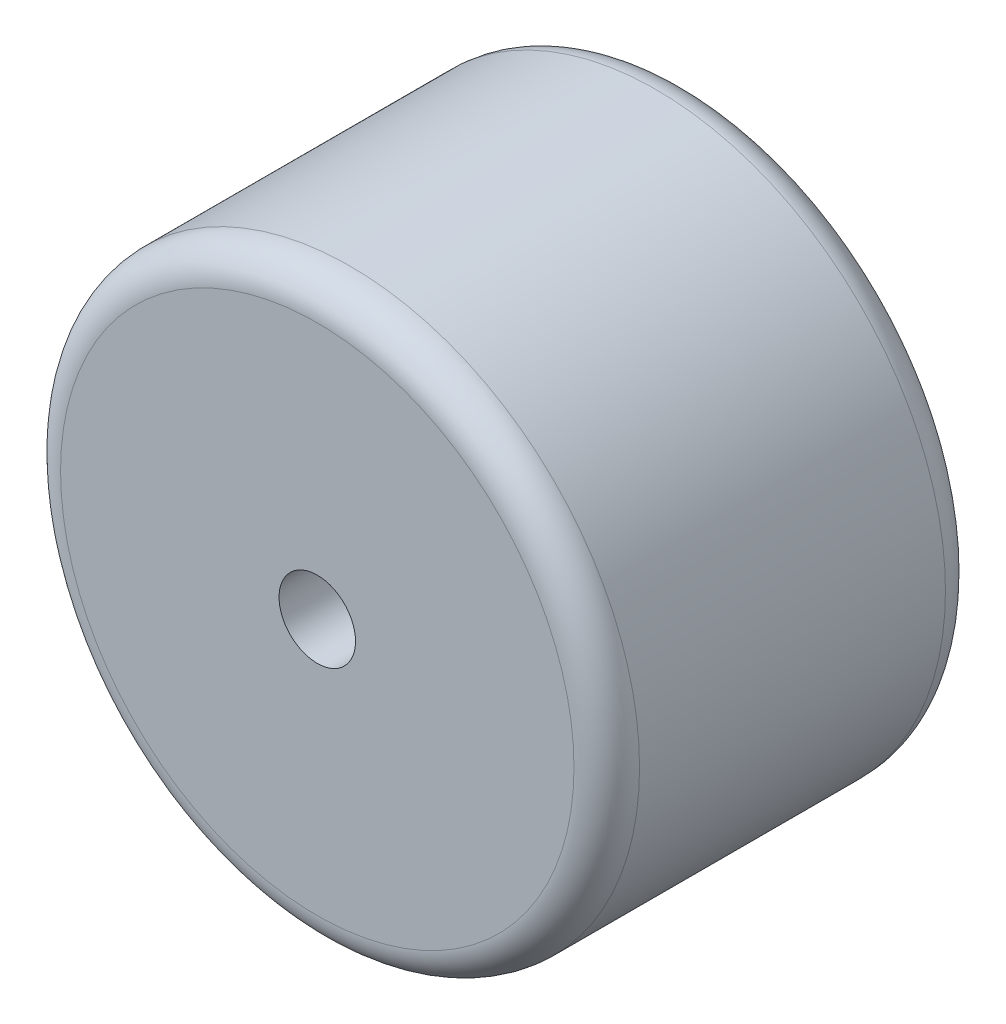
ISO-10303-21;
HEADER;
FILE_DESCRIPTION(('STEP AP214'),'2;1');
FILE_NAME('part.step','',(''),(''),'','','');
FILE_SCHEMA(('AUTOMOTIVE_DESIGN { 1 0 10303 214 1 1 1 1 }'));
ENDSEC;
DATA;
#1=APPLICATION_CONTEXT('core data for automotive mechanical design processes');
#2=APPLICATION_PROTOCOL_DEFINITION('international standard','automotive_design',2000,#1);
#3=PRODUCT_CONTEXT('',#1,'mechanical');
#4=PRODUCT('Part','Part','',(#3));
#5=PRODUCT_RELATED_PRODUCT_CATEGORY('part','',(#4));
#6=PRODUCT_DEFINITION_FORMATION('','',#4);
#7=PRODUCT_DEFINITION_CONTEXT('part definition',#1,'design');
#8=PRODUCT_DEFINITION('design','',#6,#7);
#9=PRODUCT_DEFINITION_SHAPE('','',#8);
#10=(LENGTH_UNIT() NAMED_UNIT(*) SI_UNIT(.MILLI.,.METRE.));
#11=(NAMED_UNIT(*) PLANE_ANGLE_UNIT() SI_UNIT($,.RADIAN.));
#12=(NAMED_UNIT(*) SI_UNIT($,.STERADIAN.) SOLID_ANGLE_UNIT());
#13=UNCERTAINTY_MEASURE_WITH_UNIT(LENGTH_MEASURE(1.E-05),#10,'distance_accuracy_value','');
#14=(GEOMETRIC_REPRESENTATION_CONTEXT(3) GLOBAL_UNCERTAINTY_ASSIGNED_CONTEXT((#13)) GLOBAL_UNIT_ASSIGNED_CONTEXT((#10,
#11,#12)) REPRESENTATION_CONTEXT('',''));
#15=CARTESIAN_POINT('',(0.,0.,0.));
#16=DIRECTION('',(0.,0.,1.));
#17=DIRECTION('',(1.,0.,0.));
#18=AXIS2_PLACEMENT_3D('',#15,#16,#17);
#19=CARTESIAN_POINT('',(0.,0.,34.));
#20=DIRECTION('',(0.,0.,-1.));
#21=DIRECTION('',(-1.,0.,0.));
#22=AXIS2_PLACEMENT_3D('',#19,#20,#21);
#23=CYLINDRICAL_SURFACE('',#22,26.5);
#24=CARTESIAN_POINT('',(0.,0.,3.));
#25=DIRECTION('',(0.,0.,1.));
#26=DIRECTION('',(1.,0.,0.));
#27=AXIS2_PLACEMENT_3D('',#24,#25,#26);
#28=CIRCLE('',#27,26.5);
#29=CARTESIAN_POINT('',(26.5,0.,3.));
#30=VERTEX_POINT('',#29);
#31=EDGE_CURVE('E42',#30,#30,#28,.T.);
#32=ORIENTED_EDGE('',*,*,#31,.T.);
#33=EDGE_LOOP('',(#32));
#34=FACE_BOUND('',#33,.T.);
#35=CARTESIAN_POINT('',(0.,0.,31.));
#36=DIRECTION('',(0.,0.,1.));
#37=DIRECTION('',(1.,0.,0.));
#38=AXIS2_PLACEMENT_3D('',#35,#36,#37);
#39=CIRCLE('',#38,26.5);
#40=CARTESIAN_POINT('',(26.5,0.,31.));
#41=VERTEX_POINT('',#40);
#42=EDGE_CURVE('E46',#41,#41,#39,.F.);
#43=ORIENTED_EDGE('',*,*,#42,.T.);
#44=EDGE_LOOP('',(#43));
#45=FACE_BOUND('',#44,.T.);
#46=ADVANCED_FACE('F31',(#34,#45),#23,.T.);
#47=CARTESIAN_POINT('',(0.,0.,34.));
#48=DIRECTION('',(0.,0.,1.));
#49=DIRECTION('',(1.,0.,0.));
#50=AXIS2_PLACEMENT_3D('',#47,#48,#49);
#51=PLANE('',#50);
#52=CARTESIAN_POINT('',(0.,0.,34.));
#53=DIRECTION('',(0.,0.,1.));
#54=DIRECTION('',(1.,0.,0.));
#55=AXIS2_PLACEMENT_3D('',#52,#53,#54);
#56=CIRCLE('',#55,3.5);
#57=CARTESIAN_POINT('',(3.5,0.,34.));
#58=VERTEX_POINT('',#57);
#59=EDGE_CURVE('E54',#58,#58,#56,.T.);
#60=ORIENTED_EDGE('',*,*,#59,.F.);
#61=EDGE_LOOP('',(#60));
#62=FACE_BOUND('',#61,.T.);
#63=CARTESIAN_POINT('',(0.,0.,34.));
#64=DIRECTION('',(0.,0.,1.));
#65=DIRECTION('',(1.,0.,0.));
#66=AXIS2_PLACEMENT_3D('',#63,#64,#65);
#67=CIRCLE('',#66,23.5);
#68=CARTESIAN_POINT('',(23.5,0.,34.));
#69=VERTEX_POINT('',#68);
#70=EDGE_CURVE('E10',#69,#69,#67,.T.);
#71=ORIENTED_EDGE('',*,*,#70,.T.);
#72=EDGE_LOOP('',(#71));
#73=FACE_BOUND('',#72,.T.);
#74=ADVANCED_FACE('F61',(#62,#73),#51,.T.);
#75=CARTESIAN_POINT('',(0.,0.,0.));
#76=DIRECTION('',(0.,0.,1.));
#77=DIRECTION('',(1.,0.,0.));
#78=AXIS2_PLACEMENT_3D('',#75,#76,#77);
#79=PLANE('',#78);
#80=CARTESIAN_POINT('',(0.,0.,0.));
#81=DIRECTION('',(0.,0.,1.));
#82=DIRECTION('',(1.,0.,0.));
#83=AXIS2_PLACEMENT_3D('',#80,#81,#82);
#84=CIRCLE('',#83,3.5);
#85=CARTESIAN_POINT('',(3.5,0.,0.));
#86=VERTEX_POINT('',#85);
#87=EDGE_CURVE('E51',#86,#86,#84,.F.);
#88=ORIENTED_EDGE('',*,*,#87,.F.);
#89=EDGE_LOOP('',(#88));
#90=FACE_BOUND('',#89,.T.);
#91=CARTESIAN_POINT('',(0.,0.,0.));
#92=DIRECTION('',(0.,0.,1.));
#93=DIRECTION('',(1.,0.,0.));
#94=AXIS2_PLACEMENT_3D('',#91,#92,#93);
#95=CIRCLE('',#94,23.5);
#96=CARTESIAN_POINT('',(23.5,0.,0.));
#97=VERTEX_POINT('',#96);
#98=EDGE_CURVE('E38',#97,#97,#95,.F.);
#99=ORIENTED_EDGE('',*,*,#98,.T.);
#100=EDGE_LOOP('',(#99));
#101=FACE_BOUND('',#100,.T.);
#102=ADVANCED_FACE('F63',(#90,#101),#79,.F.);
#103=CARTESIAN_POINT('',(0.,0.,3.));
#104=DIRECTION('',(0.,0.,1.));
#105=DIRECTION('',(1.,0.,0.));
#106=AXIS2_PLACEMENT_3D('',#103,#104,#105);
#107=TOROIDAL_SURFACE('',#106,23.5,3.);
#108=ORIENTED_EDGE('',*,*,#98,.F.);
#109=EDGE_LOOP('',(#108));
#110=FACE_BOUND('',#109,.T.);
#111=ORIENTED_EDGE('',*,*,#31,.F.);
#112=EDGE_LOOP('',(#111));
#113=FACE_BOUND('',#112,.T.);
#114=ADVANCED_FACE('F69',(#110,#113),#107,.T.);
#115=CARTESIAN_POINT('',(0.,0.,31.));
#116=DIRECTION('',(0.,0.,1.));
#117=DIRECTION('',(1.,0.,0.));
#118=AXIS2_PLACEMENT_3D('',#115,#116,#117);
#119=TOROIDAL_SURFACE('',#118,23.5,3.);
#120=ORIENTED_EDGE('',*,*,#42,.F.);
#121=EDGE_LOOP('',(#120));
#122=FACE_BOUND('',#121,.T.);
#123=ORIENTED_EDGE('',*,*,#70,.F.);
#124=EDGE_LOOP('',(#123));
#125=FACE_BOUND('',#124,.T.);
#126=ADVANCED_FACE('F33',(#122,#125),#119,.T.);
#127=CARTESIAN_POINT('',(0.,0.,-0.001000000000001));
#128=DIRECTION('',(0.,0.,1.));
#129=DIRECTION('',(1.,0.,0.));
#130=AXIS2_PLACEMENT_3D('',#127,#128,#129);
#131=CYLINDRICAL_SURFACE('',#130,3.5);
#132=ORIENTED_EDGE('',*,*,#59,.T.);
#133=EDGE_LOOP('',(#132));
#134=FACE_BOUND('',#133,.T.);
#135=ORIENTED_EDGE('',*,*,#87,.T.);
#136=EDGE_LOOP('',(#135));
#137=FACE_BOUND('',#136,.T.);
#138=ADVANCED_FACE('F58',(#134,#137),#131,.F.);
#139=CLOSED_SHELL('',(#46,#74,#102,#114,#126,#138));
#140=MANIFOLD_SOLID_BREP('B2',#139);
#141=ADVANCED_BREP_SHAPE_REPRESENTATION('',(#18,#140),#14);
#142=SHAPE_DEFINITION_REPRESENTATION(#9,#141);
ENDSEC;
END-ISO-10303-21;
